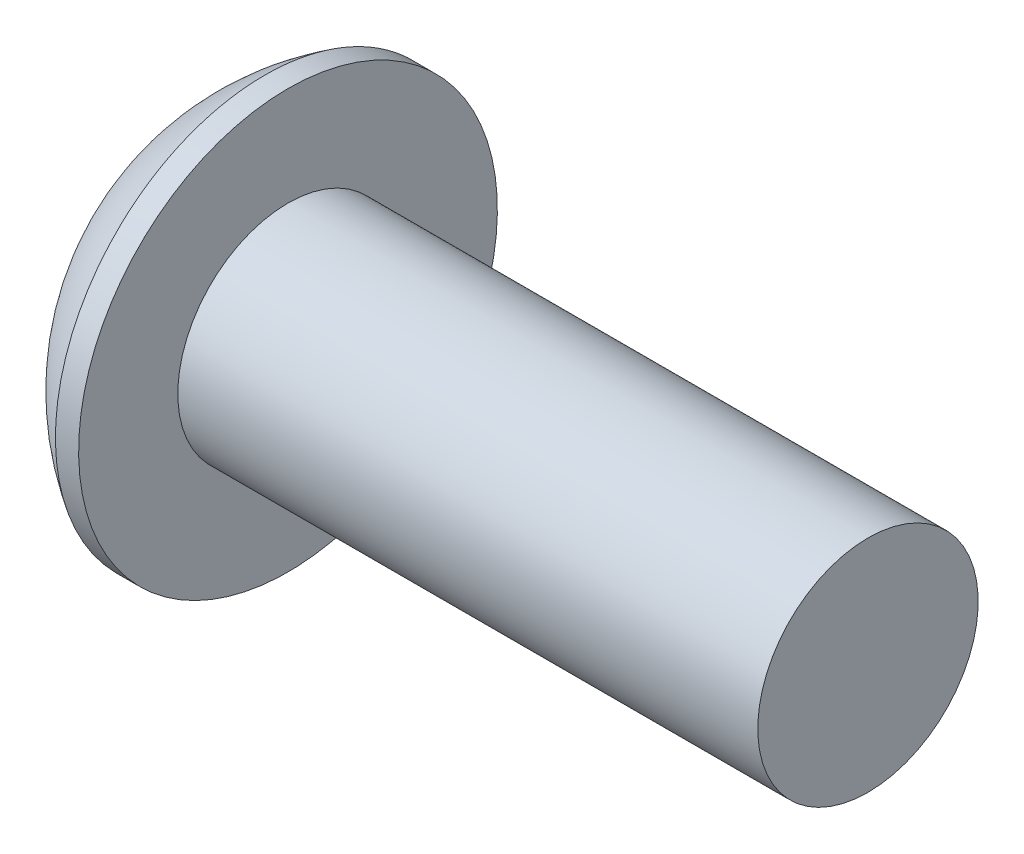
ISO-10303-21;
HEADER;
FILE_DESCRIPTION(('STEP AP214'),'2;1');
FILE_NAME('part.step','',(''),(''),'','','');
FILE_SCHEMA(('AUTOMOTIVE_DESIGN { 1 0 10303 214 1 1 1 1 }'));
ENDSEC;
DATA;
#1=APPLICATION_CONTEXT('core data for automotive mechanical design processes');
#2=APPLICATION_PROTOCOL_DEFINITION('international standard','automotive_design',2000,#1);
#3=PRODUCT_CONTEXT('',#1,'mechanical');
#4=PRODUCT('Part','Part','',(#3));
#5=PRODUCT_RELATED_PRODUCT_CATEGORY('part','',(#4));
#6=PRODUCT_DEFINITION_FORMATION('','',#4);
#7=PRODUCT_DEFINITION_CONTEXT('part definition',#1,'design');
#8=PRODUCT_DEFINITION('design','',#6,#7);
#9=PRODUCT_DEFINITION_SHAPE('','',#8);
#10=(LENGTH_UNIT() NAMED_UNIT(*) SI_UNIT(.MILLI.,.METRE.));
#11=(NAMED_UNIT(*) PLANE_ANGLE_UNIT() SI_UNIT($,.RADIAN.));
#12=(NAMED_UNIT(*) SI_UNIT($,.STERADIAN.) SOLID_ANGLE_UNIT());
#13=UNCERTAINTY_MEASURE_WITH_UNIT(LENGTH_MEASURE(1.E-05),#10,'distance_accuracy_value','');
#14=(GEOMETRIC_REPRESENTATION_CONTEXT(3) GLOBAL_UNCERTAINTY_ASSIGNED_CONTEXT((#13)) GLOBAL_UNIT_ASSIGNED_CONTEXT((#10,
#11,#12)) REPRESENTATION_CONTEXT('',''));
#15=CARTESIAN_POINT('',(0.,0.,0.));
#16=DIRECTION('',(0.,0.,1.));
#17=DIRECTION('',(1.,0.,0.));
#18=AXIS2_PLACEMENT_3D('',#15,#16,#17);
#19=CARTESIAN_POINT('',(-0.533400000000002,0.,0.));
#20=DIRECTION('',(-1.,0.,0.));
#21=DIRECTION('',(0.,0.,1.));
#22=AXIS2_PLACEMENT_3D('',#19,#20,#21);
#23=PLANE('',#22);
#24=DIRECTION('',(0.,0.5,0.866025403784439));
#25=VECTOR('',#24,1.);
#26=CARTESIAN_POINT('',(-0.533400000000002,1.83308710467706,0.));
#27=LINE('',#26,#25);
#28=CARTESIAN_POINT('',(-0.533400000000002,1.83308710467706,0.));
#29=VERTEX_POINT('',#28);
#30=CARTESIAN_POINT('',(-0.533400000000002,0.916543552338531,-1.5875));
#31=VERTEX_POINT('',#30);
#32=EDGE_CURVE('E115',#29,#31,#27,.F.);
#33=ORIENTED_EDGE('',*,*,#32,.T.);
#34=DIRECTION('',(0.,1.,0.));
#35=VECTOR('',#34,1.);
#36=CARTESIAN_POINT('',(-0.533400000000002,0.916543552338531,-1.5875));
#37=LINE('',#36,#35);
#38=CARTESIAN_POINT('',(-0.533400000000002,-0.916543552338531,-1.5875));
#39=VERTEX_POINT('',#38);
#40=EDGE_CURVE('E82',#31,#39,#37,.F.);
#41=ORIENTED_EDGE('',*,*,#40,.T.);
#42=DIRECTION('',(0.,0.5,-0.866025403784439));
#43=VECTOR('',#42,1.);
#44=CARTESIAN_POINT('',(-0.533400000000002,-0.916543552338531,-1.5875));
#45=LINE('',#44,#43);
#46=CARTESIAN_POINT('',(-0.533400000000002,-1.83308710467706,0.));
#47=VERTEX_POINT('',#46);
#48=EDGE_CURVE('E84',#39,#47,#45,.F.);
#49=ORIENTED_EDGE('',*,*,#48,.T.);
#50=DIRECTION('',(0.,-0.5,-0.866025403784439));
#51=VECTOR('',#50,1.);
#52=CARTESIAN_POINT('',(-0.533400000000002,-1.83308710467706,0.));
#53=LINE('',#52,#51);
#54=CARTESIAN_POINT('',(-0.533400000000002,-0.916543552338533,1.5875));
#55=VERTEX_POINT('',#54);
#56=EDGE_CURVE('E85',#47,#55,#53,.F.);
#57=ORIENTED_EDGE('',*,*,#56,.T.);
#58=DIRECTION('',(0.,-1.,0.));
#59=VECTOR('',#58,1.);
#60=CARTESIAN_POINT('',(-0.533400000000002,-0.916543552338532,1.5875));
#61=LINE('',#60,#59);
#62=CARTESIAN_POINT('',(-0.533400000000002,0.916543552338531,1.5875));
#63=VERTEX_POINT('',#62);
#64=EDGE_CURVE('E71',#55,#63,#61,.F.);
#65=ORIENTED_EDGE('',*,*,#64,.T.);
#66=DIRECTION('',(0.,-0.5,0.866025403784439));
#67=VECTOR('',#66,1.);
#68=CARTESIAN_POINT('',(-0.533400000000002,0.916543552338531,1.5875));
#69=LINE('',#68,#67);
#70=EDGE_CURVE('E110',#63,#29,#69,.F.);
#71=ORIENTED_EDGE('',*,*,#70,.T.);
#72=EDGE_LOOP('',(#33,#41,#49,#57,#65,#71));
#73=FACE_BOUND('',#72,.T.);
#74=ADVANCED_FACE('F17',(#73),#23,.T.);
#75=CARTESIAN_POINT('',(-0.533400000000002,-1.83308710467706,0.));
#76=DIRECTION('',(0.,-0.866025403784439,0.5));
#77=DIRECTION('',(0.,-0.5,-0.866025403784439));
#78=AXIS2_PLACEMENT_3D('',#75,#76,#77);
#79=PLANE('',#78);
#80=CARTESIAN_POINT('',(-2.56539999994394,-1.8330871046745,-2.00804498786736E-11));
#81=CARTESIAN_POINT('',(-2.53392818229741,-1.80158505518366,0.0545631502562923));
#82=CARTESIAN_POINT('',(-2.5043050627177,-1.76955629074211,0.110038597579172));
#83=CARTESIAN_POINT('',(-2.45006639539122,-1.70424635317817,0.223158727683824));
#84=CARTESIAN_POINT('',(-2.42548101615987,-1.6709589724711,0.280814162317604));
#85=CARTESIAN_POINT('',(-2.38336609605347,-1.60383660211837,0.397073518091736));
#86=CARTESIAN_POINT('',(-2.36573072948629,-1.57001869730198,0.455647847439699));
#87=CARTESIAN_POINT('',(-2.33856008862263,-1.50163859306838,0.574085662199493));
#88=CARTESIAN_POINT('',(-2.32900454007239,-1.46707848106388,0.633945532106421));
#89=CARTESIAN_POINT('',(-2.32038274183869,-1.40751253669323,0.737116774157155));
#90=CARTESIAN_POINT('',(-2.31910682172836,-1.38258360390154,0.780294952330845));
#91=CARTESIAN_POINT('',(-2.32125913780735,-1.33276652395073,0.866580665890379));
#92=CARTESIAN_POINT('',(-2.32468902284537,-1.30787839414808,0.90968817121394));
#93=CARTESIAN_POINT('',(-2.33605631415915,-1.25834345643267,0.995485200086784));
#94=CARTESIAN_POINT('',(-2.34399762019329,-1.23369687609494,1.03817432946455));
#95=CARTESIAN_POINT('',(-2.36395627681902,-1.18481740842653,1.12283605091316));
#96=CARTESIAN_POINT('',(-2.37597537628367,-1.16058470328902,1.16480832741616));
#97=CARTESIAN_POINT('',(-2.41164383187845,-1.09853862948576,1.27227527965358));
#98=CARTESIAN_POINT('',(-2.43797770752625,-1.06110942924036,1.33710455616529));
#99=CARTESIAN_POINT('',(-2.48243061452926,-1.00607390269188,1.43242888436855));
#100=CARTESIAN_POINT('',(-2.49804835924321,-0.987937988038022,1.46384120999077));
#101=CARTESIAN_POINT('',(-2.53070945051393,-0.951999508520197,1.52608848246242));
#102=CARTESIAN_POINT('',(-2.54775211871235,-0.934196789917587,1.55692369559499));
#103=CARTESIAN_POINT('',(-2.56539999993807,-0.916543552329633,1.58750000001541));
#104=B_SPLINE_CURVE_WITH_KNOTS('',3,(#80,#81,#82,#83,#84,#85,#86,#87,#88,#89,#90,#91,#92,#93,
#94,#95,#96,#97,#98,#99,#100,#101,#102,#103),.UNSPECIFIED.,.F.,.F.,(4,2,2,2,2,2,2,2,2,2,2,4),
(0.,0.211427927732169,0.424087197148228,0.633370156422424,0.842126401515785,0.991537201098734,
1.14100036552056,1.29059292577265,1.44024972414947,1.67781721417335,1.79627069411587,
1.91466809995991),.UNSPECIFIED.);
#105=CARTESIAN_POINT('',(-2.56539999993857,-1.83308710468646,0.));
#106=VERTEX_POINT('',#105);
#107=CARTESIAN_POINT('',(-2.56539999993106,-0.916543552342318,1.5875));
#108=VERTEX_POINT('',#107);
#109=EDGE_CURVE('E20',#106,#108,#104,.T.);
#110=ORIENTED_EDGE('',*,*,#109,.T.);
#111=DIRECTION('',(1.,0.,0.));
#112=VECTOR('',#111,1.);
#113=CARTESIAN_POINT('',(-0.533400000000002,-0.916543552338533,1.5875));
#114=LINE('',#113,#112);
#115=EDGE_CURVE('E90',#108,#55,#114,.T.);
#116=ORIENTED_EDGE('',*,*,#115,.T.);
#117=ORIENTED_EDGE('',*,*,#56,.F.);
#118=DIRECTION('',(1.,0.,0.));
#119=VECTOR('',#118,1.);
#120=CARTESIAN_POINT('',(-0.533400000000002,-1.83308710467706,0.));
#121=LINE('',#120,#119);
#122=EDGE_CURVE('E58',#47,#106,#121,.F.);
#123=ORIENTED_EDGE('',*,*,#122,.T.);
#124=EDGE_LOOP('',(#110,#116,#117,#123));
#125=FACE_BOUND('',#124,.T.);
#126=ADVANCED_FACE('F89',(#125),#79,.F.);
#127=CARTESIAN_POINT('',(-0.533400000000002,-0.916543552338531,-1.5875));
#128=DIRECTION('',(0.,-0.866025403784439,-0.5));
#129=DIRECTION('',(0.,0.5,-0.866025403784439));
#130=AXIS2_PLACEMENT_3D('',#127,#128,#129);
#131=PLANE('',#130);
#132=CARTESIAN_POINT('',(-2.56539999994527,-0.916543552319403,-1.58750000001409));
#133=CARTESIAN_POINT('',(-2.53392818229919,-0.948045601822691,-1.53293684974403));
#134=CARTESIAN_POINT('',(-2.50430506271949,-0.980074366269487,-1.47746140242354));
#135=CARTESIAN_POINT('',(-2.45006639539264,-1.04538430383757,-1.36434127232016));
#136=CARTESIAN_POINT('',(-2.42548101616093,-1.07867168454351,-1.30668583768523));
#137=CARTESIAN_POINT('',(-2.38336609605398,-1.14579405489574,-1.19042648190974));
#138=CARTESIAN_POINT('',(-2.36573072948662,-1.17961195971273,-1.13185215256154));
#139=CARTESIAN_POINT('',(-2.3385600886227,-1.2479920639471,-1.013414337801));
#140=CARTESIAN_POINT('',(-2.32900454007237,-1.28255217595175,-0.953554467893575));
#141=CARTESIAN_POINT('',(-2.32038274183866,-1.34211812032265,-0.850383225842316));
#142=CARTESIAN_POINT('',(-2.31910682172835,-1.36704705311438,-0.807205047668587));
#143=CARTESIAN_POINT('',(-2.32125913780739,-1.41686413306525,-0.720919334108961));
#144=CARTESIAN_POINT('',(-2.32468902284544,-1.44175226286793,-0.67781182878535));
#145=CARTESIAN_POINT('',(-2.33605631415929,-1.49128720058339,-0.592014799912417));
#146=CARTESIAN_POINT('',(-2.34399762019345,-1.51593378092113,-0.54932567053461));
#147=CARTESIAN_POINT('',(-2.36395627681926,-1.56481324858959,-0.464663949085931));
#148=CARTESIAN_POINT('',(-2.37597537628395,-1.58904595372712,-0.422691672582891));
#149=CARTESIAN_POINT('',(-2.41164383187876,-1.65109202753029,-0.315224720345625));
#150=CARTESIAN_POINT('',(-2.43797770752652,-1.6885212277756,-0.250395443834082));
#151=CARTESIAN_POINT('',(-2.48243061452944,-1.74355675432393,-0.15507111563107));
#152=CARTESIAN_POINT('',(-2.49804835924337,-1.76169266897775,-0.123658790008927));
#153=CARTESIAN_POINT('',(-2.53070945051401,-1.79763114849548,-0.0614115175374324));
#154=CARTESIAN_POINT('',(-2.5477521187124,-1.81543386709805,-0.0305763044049344));
#155=CARTESIAN_POINT('',(-2.56539999993807,-1.83308710468596,1.54136844652939E-11));
#156=B_SPLINE_CURVE_WITH_KNOTS('',3,(#132,#133,#134,#135,#136,#137,#138,#139,#140,#141,#142,
#143,#144,#145,#146,#147,#148,#149,#150,#151,#152,#153,#154,#155),.UNSPECIFIED.,.F.,.F.,(4,2,2,
2,2,2,2,2,2,2,2,4),(0.,0.211427927733669,0.424087197151313,0.633370156427101,0.842126401522016,
0.99153720110513,1.14100036552713,1.29059292577937,1.44024972415633,1.67781721417961,
1.79627069412184,1.9146680999656),.UNSPECIFIED.);
#157=CARTESIAN_POINT('',(-2.56539999995198,-0.916543552351339,-1.58750000002218));
#158=VERTEX_POINT('',#157);
#159=EDGE_CURVE('E94',#158,#106,#156,.T.);
#160=ORIENTED_EDGE('',*,*,#159,.T.);
#161=ORIENTED_EDGE('',*,*,#122,.F.);
#162=ORIENTED_EDGE('',*,*,#48,.F.);
#163=DIRECTION('',(-1.,0.,0.));
#164=VECTOR('',#163,1.);
#165=CARTESIAN_POINT('',(-0.533400000000002,-0.916543552338531,-1.5875));
#166=LINE('',#165,#164);
#167=EDGE_CURVE('E96',#39,#158,#166,.T.);
#168=ORIENTED_EDGE('',*,*,#167,.T.);
#169=EDGE_LOOP('',(#160,#161,#162,#168));
#170=FACE_BOUND('',#169,.T.);
#171=ADVANCED_FACE('F92',(#170),#131,.F.);
#172=CARTESIAN_POINT('',(-0.533400000000002,0.916543552338531,-1.5875));
#173=DIRECTION('',(0.,0.,-1.));
#174=DIRECTION('',(-1.,0.,0.));
#175=AXIS2_PLACEMENT_3D('',#172,#173,#174);
#176=PLANE('',#175);
#177=CARTESIAN_POINT('',(-2.56539999994527,0.916543552360294,-1.58749999999048));
#178=CARTESIAN_POINT('',(-2.53392818229821,0.853539453376781,-1.58749999999657));
#179=CARTESIAN_POINT('',(-2.50430506271702,0.789481924500113,-1.58749999999908));
#180=CARTESIAN_POINT('',(-2.45006639538581,0.658862049392287,-1.58750000000093));
#181=CARTESIAN_POINT('',(-2.42548101615122,0.59228728799181,-1.58750000000025));
#182=CARTESIAN_POINT('',(-2.38336609603683,0.458042547310979,-1.58749999999976));
#183=CARTESIAN_POINT('',(-2.36573072946494,0.390406737689213,-1.58749999999994));
#184=CARTESIAN_POINT('',(-2.3385600885904,0.253646529243895,-1.58750000000006));
#185=CARTESIAN_POINT('',(-2.32900454003397,0.184526305245804,-1.58750000000001));
#186=CARTESIAN_POINT('',(-2.32038274178942,0.0653944165301613,-1.58749999999999));
#187=CARTESIAN_POINT('',(-2.31910682167392,0.0155365509618711,-1.5875));
#188=CARTESIAN_POINT('',(-2.3212591377409,-0.0840976089101244,-1.5875));
#189=CARTESIAN_POINT('',(-2.32468902277208,-0.133873868500894,-1.5875));
#190=CARTESIAN_POINT('',(-2.33605631407098,-0.2329437439033,-1.5875));
#191=CARTESIAN_POINT('',(-2.34399762009707,-0.282236904564879,-1.5875));
#192=CARTESIAN_POINT('',(-2.36395627670599,-0.379995839874564,-1.5875));
#193=CARTESIAN_POINT('',(-2.37597537616188,-0.428461250136325,-1.5875));
#194=CARTESIAN_POINT('',(-2.41164383175616,-0.552553397787632,-1.5875));
#195=CARTESIAN_POINT('',(-2.43797770742117,-0.627411798334259,-1.5875));
#196=CARTESIAN_POINT('',(-2.48243061445881,-0.737482851511091,-1.5875));
#197=CARTESIAN_POINT('',(-2.49804835918582,-0.773754680844889,-1.5875));
#198=CARTESIAN_POINT('',(-2.53070945048496,-0.845631639931401,-1.5875));
#199=CARTESIAN_POINT('',(-2.54775211869874,-0.881237077161412,-1.5875));
#200=CARTESIAN_POINT('',(-2.56539999994071,-0.916543552361606,-1.5875));
#201=B_SPLINE_CURVE_WITH_KNOTS('',3,(#177,#178,#179,#180,#181,#182,#183,#184,#185,#186,#187,
#188,#189,#190,#191,#192,#193,#194,#195,#196,#197,#198,#199,#200),.UNSPECIFIED.,.F.,.F.,(4,2,2,
2,2,2,2,2,2,2,2,4),(0.,0.211427927701375,0.424087197086717,0.633370156331471,0.842126401395377,
0.991537200933545,1.14100036531054,1.29059292551773,1.44024972384963,1.677817214047,
1.79627069407681,1.91466810000777),.UNSPECIFIED.);
#202=CARTESIAN_POINT('',(-2.56539999995198,0.916543552337129,-1.58749999999757));
#203=VERTEX_POINT('',#202);
#204=EDGE_CURVE('E198',#203,#158,#201,.T.);
#205=ORIENTED_EDGE('',*,*,#204,.T.);
#206=ORIENTED_EDGE('',*,*,#167,.F.);
#207=ORIENTED_EDGE('',*,*,#40,.F.);
#208=DIRECTION('',(1.,0.,0.));
#209=VECTOR('',#208,1.);
#210=CARTESIAN_POINT('',(-0.533400000000002,0.916543552338531,-1.5875));
#211=LINE('',#210,#209);
#212=EDGE_CURVE('E112',#31,#203,#211,.F.);
#213=ORIENTED_EDGE('',*,*,#212,.T.);
#214=EDGE_LOOP('',(#205,#206,#207,#213));
#215=FACE_BOUND('',#214,.T.);
#216=ADVANCED_FACE('F188',(#215),#176,.F.);
#217=CARTESIAN_POINT('',(-0.533400000000002,1.83308710467706,0.));
#218=DIRECTION('',(0.,0.866025403784439,-0.5));
#219=DIRECTION('',(0.,0.5,0.866025403784439));
#220=AXIS2_PLACEMENT_3D('',#217,#218,#219);
#221=PLANE('',#220);
#222=CARTESIAN_POINT('',(-2.56539999994394,1.8330871046745,2.00800374309997E-11));
#223=CARTESIAN_POINT('',(-2.5339281822974,1.80158505518366,-0.0545631502562965));
#224=CARTESIAN_POINT('',(-2.5043050627177,1.76955629074211,-0.11003859757918));
#225=CARTESIAN_POINT('',(-2.45006639539121,1.70424635317816,-0.22315872768384));
#226=CARTESIAN_POINT('',(-2.42548101615987,1.67095897247109,-0.280814162317626));
#227=CARTESIAN_POINT('',(-2.38336609605347,1.60383660211835,-0.397073518091758));
#228=CARTESIAN_POINT('',(-2.36573072948628,1.57001869730197,-0.455647847439717));
#229=CARTESIAN_POINT('',(-2.33856008862263,1.50163859306837,-0.574085662199503));
#230=CARTESIAN_POINT('',(-2.32900454007239,1.46707848106388,-0.633945532106426));
#231=CARTESIAN_POINT('',(-2.32038274183869,1.40751253669322,-0.737116774157154));
#232=CARTESIAN_POINT('',(-2.31910682172836,1.38258360390154,-0.780294952330843));
#233=CARTESIAN_POINT('',(-2.32125913780735,1.33276652395073,-0.866580665890374));
#234=CARTESIAN_POINT('',(-2.32468902284537,1.30787839414808,-0.909688171213933));
#235=CARTESIAN_POINT('',(-2.33605631415915,1.25834345643267,-0.995485200086777));
#236=CARTESIAN_POINT('',(-2.34399762019328,1.23369687609495,-1.03817432946455));
#237=CARTESIAN_POINT('',(-2.36395627681902,1.18481740842653,-1.12283605091316));
#238=CARTESIAN_POINT('',(-2.37597537628367,1.16058470328902,-1.16480832741616));
#239=CARTESIAN_POINT('',(-2.41164383187872,1.09853862948529,-1.2722752796544));
#240=CARTESIAN_POINT('',(-2.43797770752691,1.06110942923942,-1.33710455616691));
#241=CARTESIAN_POINT('',(-2.48243061453059,1.00607390269029,-1.43242888437131));
#242=CARTESIAN_POINT('',(-2.49804835924479,0.987937988036214,-1.4638412099939));
#243=CARTESIAN_POINT('',(-2.53070945051602,0.951999508517968,-1.52608848246628));
#244=CARTESIAN_POINT('',(-2.54775211871471,0.934196789915152,-1.55692369559921));
#245=CARTESIAN_POINT('',(-2.56539999994071,0.916543552326994,-1.58750000001998));
#246=B_SPLINE_CURVE_WITH_KNOTS('',3,(#222,#223,#224,#225,#226,#227,#228,#229,#230,#231,#232,
#233,#234,#235,#236,#237,#238,#239,#240,#241,#242,#243,#244,#245),.UNSPECIFIED.,.F.,.F.,(4,2,2,
2,2,2,2,2,2,2,2,4),(0.,0.211427927732185,0.424087197148259,0.63337015642244,0.842126401515786,
0.99153720109873,1.14100036552055,1.29059292577265,1.44024972414947,1.67781721417631,
1.7962706941203,1.9146680999658),.UNSPECIFIED.);
#247=CARTESIAN_POINT('',(-2.56539999993857,1.83308710468646,0.));
#248=VERTEX_POINT('',#247);
#249=EDGE_CURVE('E192',#248,#203,#246,.T.);
#250=ORIENTED_EDGE('',*,*,#249,.T.);
#251=ORIENTED_EDGE('',*,*,#212,.F.);
#252=ORIENTED_EDGE('',*,*,#32,.F.);
#253=DIRECTION('',(1.,0.,0.));
#254=VECTOR('',#253,1.);
#255=CARTESIAN_POINT('',(-0.533400000000002,1.83308710467706,0.));
#256=LINE('',#255,#254);
#257=EDGE_CURVE('E107',#29,#248,#256,.F.);
#258=ORIENTED_EDGE('',*,*,#257,.T.);
#259=EDGE_LOOP('',(#250,#251,#252,#258));
#260=FACE_BOUND('',#259,.T.);
#261=ADVANCED_FACE('F184',(#260),#221,.F.);
#262=CARTESIAN_POINT('',(-0.533400000000002,0.916543552338531,1.5875));
#263=DIRECTION('',(0.,0.866025403784439,0.5));
#264=DIRECTION('',(0.,-0.5,0.866025403784439));
#265=AXIS2_PLACEMENT_3D('',#262,#263,#264);
#266=PLANE('',#265);
#267=CARTESIAN_POINT('',(-2.56539999994394,0.91654355231986,1.58750000000782));
#268=CARTESIAN_POINT('',(-2.53392818229741,0.948045601824288,1.5329368497393));
#269=CARTESIAN_POINT('',(-2.5043050627177,0.980074366271431,1.47746140241964));
#270=CARTESIAN_POINT('',(-2.45006639539122,1.04538430383949,1.36434127231737));
#271=CARTESIAN_POINT('',(-2.42548101615987,1.07867168454504,1.30668583768271));
#272=CARTESIAN_POINT('',(-2.38336609605347,1.14579405489669,1.19042648190795));
#273=CARTESIAN_POINT('',(-2.36573072948629,1.17961195971347,1.13185215256022));
#274=CARTESIAN_POINT('',(-2.33856008862263,1.24799206394736,1.01341433780059));
#275=CARTESIAN_POINT('',(-2.32900454007239,1.28255217595174,0.953554467893597));
#276=CARTESIAN_POINT('',(-2.32038274183869,1.34211812032234,0.850383225842832));
#277=CARTESIAN_POINT('',(-2.31910682172836,1.36704705311405,0.807205047669152));
#278=CARTESIAN_POINT('',(-2.32125913780735,1.41686413306487,0.720919334109624));
#279=CARTESIAN_POINT('',(-2.32468902284537,1.44175226286752,0.677811828786061));
#280=CARTESIAN_POINT('',(-2.33605631415915,1.49128720058292,0.592014799913215));
#281=CARTESIAN_POINT('',(-2.34399762019328,1.51593378092065,0.549325670535446));
#282=CARTESIAN_POINT('',(-2.36395627681902,1.56481324858906,0.464663949086841));
#283=CARTESIAN_POINT('',(-2.37597537628367,1.58904595372657,0.422691672583837));
#284=CARTESIAN_POINT('',(-2.41164383187845,1.65109202752983,0.315224720346425));
#285=CARTESIAN_POINT('',(-2.43797770752625,1.68852122777524,0.250395443834706));
#286=CARTESIAN_POINT('',(-2.48243061452926,1.74355675432371,0.155071115631445));
#287=CARTESIAN_POINT('',(-2.49804835924321,1.76169266897757,0.123658790009225));
#288=CARTESIAN_POINT('',(-2.53070945051393,1.7976311484954,0.0614115175375789));
#289=CARTESIAN_POINT('',(-2.54775211871235,1.81543386709801,0.0305763044050067));
#290=CARTESIAN_POINT('',(-2.56539999993807,1.83308710468596,-1.54142580803093E-11));
#291=B_SPLINE_CURVE_WITH_KNOTS('',3,(#267,#268,#269,#270,#271,#272,#273,#274,#275,#276,#277,
#278,#279,#280,#281,#282,#283,#284,#285,#286,#287,#288,#289,#290),.UNSPECIFIED.,.F.,.F.,(4,2,2,
2,2,2,2,2,2,2,2,4),(0.,0.211427927732169,0.424087197148227,0.633370156422423,0.842126401515785,
0.991537201098733,1.14100036552056,1.29059292577265,1.44024972414946,1.67781721417335,
1.79627069411587,1.91466809995991),.UNSPECIFIED.);
#292=CARTESIAN_POINT('',(-2.56539999993857,0.91654355234323,1.58750000000814));
#293=VERTEX_POINT('',#292);
#294=EDGE_CURVE('E166',#293,#248,#291,.T.);
#295=ORIENTED_EDGE('',*,*,#294,.T.);
#296=ORIENTED_EDGE('',*,*,#257,.F.);
#297=ORIENTED_EDGE('',*,*,#70,.F.);
#298=DIRECTION('',(1.,0.,0.));
#299=VECTOR('',#298,1.);
#300=CARTESIAN_POINT('',(-0.533400000000002,0.916543552338531,1.5875));
#301=LINE('',#300,#299);
#302=EDGE_CURVE('E39',#63,#293,#301,.F.);
#303=ORIENTED_EDGE('',*,*,#302,.T.);
#304=EDGE_LOOP('',(#295,#296,#297,#303));
#305=FACE_BOUND('',#304,.T.);
#306=ADVANCED_FACE('F177',(#305),#266,.F.);
#307=CARTESIAN_POINT('',(-0.533400000000002,-0.916543552338532,1.5875));
#308=DIRECTION('',(0.,0.,1.));
#309=DIRECTION('',(0.,-1.,0.));
#310=AXIS2_PLACEMENT_3D('',#307,#308,#309);
#311=PLANE('',#310);
#312=CARTESIAN_POINT('',(-2.56539999994394,-0.916543552354642,1.58749999998774));
#313=CARTESIAN_POINT('',(-2.53392818229741,-0.853539453359365,1.58749999999559));
#314=CARTESIAN_POINT('',(-2.50430506271771,-0.789481924470656,1.58749999999882));
#315=CARTESIAN_POINT('',(-2.45006639539122,-0.658862049338629,1.58750000000119));
#316=CARTESIAN_POINT('',(-2.42548101615988,-0.592287287925995,1.58750000000032));
#317=CARTESIAN_POINT('',(-2.38336609605349,-0.458042547221593,1.58749999999969));
#318=CARTESIAN_POINT('',(-2.36573072948631,-0.390406737588416,1.58749999999992));
#319=CARTESIAN_POINT('',(-2.33856008862266,-0.253646529120892,1.58750000000008));
#320=CARTESIAN_POINT('',(-2.32900454007243,-0.184526305112002,1.58750000000002));
#321=CARTESIAN_POINT('',(-2.32038274183874,-0.065394416370719,1.58749999999999));
#322=CARTESIAN_POINT('',(-2.31910682172841,-0.0155365507873145,1.5875));
#323=CARTESIAN_POINT('',(-2.32125913780742,0.0840976091143436,1.5875));
#324=CARTESIAN_POINT('',(-2.32468902284545,0.133873868719661,1.5875));
#325=CARTESIAN_POINT('',(-2.33605631415924,0.232943744150505,1.5875));
#326=CARTESIAN_POINT('',(-2.34399762019338,0.282236904825971,1.5875));
#327=CARTESIAN_POINT('',(-2.36395627681913,0.379995840162817,1.5875));
#328=CARTESIAN_POINT('',(-2.37597537628379,0.428461250437852,1.5875));
#329=CARTESIAN_POINT('',(-2.41164383187857,0.552553398044325,1.5875));
#330=CARTESIAN_POINT('',(-2.43797770752636,0.627411798535089,1.5875));
#331=CARTESIAN_POINT('',(-2.48243061452933,0.737482851631955,1.5875));
#332=CARTESIAN_POINT('',(-2.49804835924327,0.773754680939651,1.5875));
#333=CARTESIAN_POINT('',(-2.53070945051396,0.84563163997525,1.5875));
#334=CARTESIAN_POINT('',(-2.54775211871237,0.881237077180446,1.5875));
#335=CARTESIAN_POINT('',(-2.56539999993807,0.91654355235633,1.5875));
#336=B_SPLINE_CURVE_WITH_KNOTS('',3,(#312,#313,#314,#315,#316,#317,#318,#319,#320,#321,#322,
#323,#324,#325,#326,#327,#328,#329,#330,#331,#332,#333,#334,#335),.UNSPECIFIED.,.F.,.F.,(4,2,2,
2,2,2,2,2,2,2,2,4),(0.,0.211427927732202,0.424087197148294,0.633370156422521,0.842126401515914,
0.991537201098908,1.14100036552078,1.29059292577292,1.44024972414978,1.67781721417349,
1.79627069411592,1.91466809995988),.UNSPECIFIED.);
#337=EDGE_CURVE('E158',#108,#293,#336,.T.);
#338=ORIENTED_EDGE('',*,*,#337,.T.);
#339=ORIENTED_EDGE('',*,*,#302,.F.);
#340=ORIENTED_EDGE('',*,*,#64,.F.);
#341=ORIENTED_EDGE('',*,*,#115,.F.);
#342=EDGE_LOOP('',(#338,#339,#340,#341));
#343=FACE_BOUND('',#342,.T.);
#344=ADVANCED_FACE('F173',(#343),#311,.F.);
#345=CARTESIAN_POINT('',(-2.56540000003724,0.,0.));
#346=DIRECTION('',(-1.,0.,0.));
#347=DIRECTION('',(0.,-1.,0.));
#348=AXIS2_PLACEMENT_3D('',#345,#346,#347);
#349=CONICAL_SURFACE('',#348,1.83308710478514,0.78539816351237);
#350=ORIENTED_EDGE('',*,*,#109,.F.);
#351=CARTESIAN_POINT('',(-2.56539999992356,0.,0.));
#352=DIRECTION('',(-1.,0.,0.));
#353=DIRECTION('',(0.,-1.,0.));
#354=AXIS2_PLACEMENT_3D('',#351,#352,#353);
#355=CIRCLE('',#354,1.83308710467145);
#356=EDGE_CURVE('E165',#108,#106,#355,.F.);
#357=ORIENTED_EDGE('',*,*,#356,.F.);
#358=EDGE_LOOP('',(#350,#357));
#359=FACE_BOUND('',#358,.T.);
#360=ADVANCED_FACE('F176',(#359),#349,.F.);
#361=CARTESIAN_POINT('',(-2.56540000003724,0.,0.));
#362=DIRECTION('',(-1.,0.,0.));
#363=DIRECTION('',(0.,-1.,0.));
#364=AXIS2_PLACEMENT_3D('',#361,#362,#363);
#365=CONICAL_SURFACE('',#364,1.83308710478514,0.78539816351237);
#366=ORIENTED_EDGE('',*,*,#159,.F.);
#367=CARTESIAN_POINT('',(-2.56539999992356,0.,0.));
#368=DIRECTION('',(-1.,0.,0.));
#369=DIRECTION('',(0.,-1.,0.));
#370=AXIS2_PLACEMENT_3D('',#367,#368,#369);
#371=CIRCLE('',#370,1.83308710467145);
#372=EDGE_CURVE('E272',#106,#158,#371,.F.);
#373=ORIENTED_EDGE('',*,*,#372,.F.);
#374=EDGE_LOOP('',(#366,#373));
#375=FACE_BOUND('',#374,.T.);
#376=ADVANCED_FACE('F210',(#375),#365,.F.);
#377=CARTESIAN_POINT('',(-2.56540000003724,0.,0.));
#378=DIRECTION('',(-1.,0.,0.));
#379=DIRECTION('',(0.,-1.,0.));
#380=AXIS2_PLACEMENT_3D('',#377,#378,#379);
#381=CONICAL_SURFACE('',#380,1.83308710478514,0.785398163397448);
#382=ORIENTED_EDGE('',*,*,#204,.F.);
#383=CARTESIAN_POINT('',(-2.5653999999804,0.,0.));
#384=DIRECTION('',(-1.,0.,0.));
#385=DIRECTION('',(0.,-1.,0.));
#386=AXIS2_PLACEMENT_3D('',#383,#384,#385);
#387=CIRCLE('',#386,1.83308710472829);
#388=EDGE_CURVE('E269',#158,#203,#387,.F.);
#389=ORIENTED_EDGE('',*,*,#388,.F.);
#390=EDGE_LOOP('',(#382,#389));
#391=FACE_BOUND('',#390,.T.);
#392=ADVANCED_FACE('F206',(#391),#381,.F.);
#393=CARTESIAN_POINT('',(-2.56540000003724,0.,0.));
#394=DIRECTION('',(-1.,0.,0.));
#395=DIRECTION('',(0.,-1.,0.));
#396=AXIS2_PLACEMENT_3D('',#393,#394,#395);
#397=CONICAL_SURFACE('',#396,1.83308710478514,0.78539816351237);
#398=ORIENTED_EDGE('',*,*,#249,.F.);
#399=CARTESIAN_POINT('',(-2.56539999992356,0.,0.));
#400=DIRECTION('',(-1.,0.,0.));
#401=DIRECTION('',(0.,-1.,0.));
#402=AXIS2_PLACEMENT_3D('',#399,#400,#401);
#403=CIRCLE('',#402,1.83308710467145);
#404=EDGE_CURVE('E266',#203,#248,#403,.F.);
#405=ORIENTED_EDGE('',*,*,#404,.F.);
#406=EDGE_LOOP('',(#398,#405));
#407=FACE_BOUND('',#406,.T.);
#408=ADVANCED_FACE('F203',(#407),#397,.F.);
#409=CARTESIAN_POINT('',(-2.56540000003724,0.,0.));
#410=DIRECTION('',(-1.,0.,0.));
#411=DIRECTION('',(0.,-1.,0.));
#412=AXIS2_PLACEMENT_3D('',#409,#410,#411);
#413=CONICAL_SURFACE('',#412,1.83308710478514,0.78539816351237);
#414=ORIENTED_EDGE('',*,*,#294,.F.);
#415=CARTESIAN_POINT('',(-2.56539999992356,0.,0.));
#416=DIRECTION('',(-1.,0.,0.));
#417=DIRECTION('',(0.,-1.,0.));
#418=AXIS2_PLACEMENT_3D('',#415,#416,#417);
#419=CIRCLE('',#418,1.83308710467145);
#420=EDGE_CURVE('E261',#248,#293,#419,.F.);
#421=ORIENTED_EDGE('',*,*,#420,.F.);
#422=EDGE_LOOP('',(#414,#421));
#423=FACE_BOUND('',#422,.T.);
#424=ADVANCED_FACE('F153',(#423),#413,.F.);
#425=CARTESIAN_POINT('',(-2.56540000003724,0.,0.));
#426=DIRECTION('',(-1.,0.,0.));
#427=DIRECTION('',(0.,-1.,0.));
#428=AXIS2_PLACEMENT_3D('',#425,#426,#427);
#429=CONICAL_SURFACE('',#428,1.83308710478514,0.785398163512485);
#430=ORIENTED_EDGE('',*,*,#337,.F.);
#431=CARTESIAN_POINT('',(-2.56539999992356,0.,0.));
#432=DIRECTION('',(-1.,0.,0.));
#433=DIRECTION('',(0.,-1.,0.));
#434=AXIS2_PLACEMENT_3D('',#431,#432,#433);
#435=CIRCLE('',#434,1.83308710467145);
#436=EDGE_CURVE('E138',#293,#108,#435,.F.);
#437=ORIENTED_EDGE('',*,*,#436,.F.);
#438=EDGE_LOOP('',(#430,#437));
#439=FACE_BOUND('',#438,.T.);
#440=ADVANCED_FACE('F148',(#439),#429,.F.);
#441=CARTESIAN_POINT('',(-2.5654,0.,0.));
#442=DIRECTION('',(-1.,0.,0.));
#443=DIRECTION('',(0.,-1.,0.));
#444=AXIS2_PLACEMENT_3D('',#441,#442,#443);
#445=PLANE('',#444);
#446=CARTESIAN_POINT('',(-2.5654,-2.29235000000002,0.));
#447=CARTESIAN_POINT('',(-2.56540000000001,-2.29234961429958,-0.0643619991867162));
#448=CARTESIAN_POINT('',(-2.56540000000002,-2.28963695190109,-0.128735826629366));
#449=CARTESIAN_POINT('',(-2.56539999999999,-2.27880393843649,-0.257038618985287));
#450=CARTESIAN_POINT('',(-2.56539999999995,-2.27068199085128,-0.320967446929163));
#451=CARTESIAN_POINT('',(-2.56540000000006,-2.24906694794257,-0.448021254607718));
#452=CARTESIAN_POINT('',(-2.56540000000021,-2.23556532653462,-0.511144793381861));
#453=CARTESIAN_POINT('',(-2.56539999999979,-2.20328400495645,-0.636065176149322));
#454=CARTESIAN_POINT('',(-2.56539999999921,-2.18450002159115,-0.697860899533935));
#455=CARTESIAN_POINT('',(-2.56539999999869,-2.12048422735804,-0.88032980292775));
#456=CARTESIAN_POINT('',(-2.56539999999995,-2.0675359907946,-0.99839179592812));
#457=CARTESIAN_POINT('',(-2.56540000000006,-1.94254204858674,-1.22393765942148));
#458=CARTESIAN_POINT('',(-2.56539999999891,-1.87049561696644,-1.33142112758208));
#459=CARTESIAN_POINT('',(-2.56539999999932,-1.74974254194881,-1.48237719670935));
#460=CARTESIAN_POINT('',(-2.56539999999982,-1.70734573132302,-1.53101280076738));
#461=CARTESIAN_POINT('',(-2.56540000000018,-1.6186391029153,-1.62450601319185));
#462=CARTESIAN_POINT('',(-2.56540000000005,-1.57233309727313,-1.66936721890417));
#463=CARTESIAN_POINT('',(-2.56539999999995,-1.47608431707234,-1.7550488420402));
#464=CARTESIAN_POINT('',(-2.56539999999999,-1.42613990458995,-1.79586741981512));
#465=CARTESIAN_POINT('',(-2.56540000000002,-1.32299452541252,-1.87315615311523));
#466=CARTESIAN_POINT('',(-2.56540000000001,-1.26979280714188,-1.90962529930697));
#467=CARTESIAN_POINT('',(-2.56539999999999,-1.10588180153953,-2.0120772215109));
#468=CARTESIAN_POINT('',(-2.5654,-0.990764947001321,-2.07119486286667));
#469=CARTESIAN_POINT('',(-2.5654,-0.752302198839727,-2.16922858468856));
#470=CARTESIAN_POINT('',(-2.5654,-0.628956393121269,-2.2081448809145));
#471=CARTESIAN_POINT('',(-2.5654,-0.377466101733277,-2.2647275576592));
#472=CARTESIAN_POINT('',(-2.5654,-0.249321590440388,-2.28239382469379));
#473=CARTESIAN_POINT('',(-2.5654,0.0081143537161001,-2.29595665980956));
#474=CARTESIAN_POINT('',(-2.5654,0.137405786579698,-2.29185322789073));
#475=CARTESIAN_POINT('',(-2.5654,0.393449386933719,-2.2620096240906));
#476=CARTESIAN_POINT('',(-2.5654,0.520201567981077,-2.23626956775766));
#477=CARTESIAN_POINT('',(-2.5654,0.767645294384444,-2.16383549332687));
#478=CARTESIAN_POINT('',(-2.5654,0.888336774993549,-2.11714125142686));
#479=CARTESIAN_POINT('',(-2.5654,1.06210572146655,-2.03247976453654));
#480=CARTESIAN_POINT('',(-2.5654,1.11884498714066,-2.00180278323696));
#481=CARTESIAN_POINT('',(-2.5654,1.22954062855572,-1.93578011658036));
#482=CARTESIAN_POINT('',(-2.5654,1.28349764565392,-1.9004355139425));
#483=CARTESIAN_POINT('',(-2.5654,1.38821676641537,-1.82534174602348));
#484=CARTESIAN_POINT('',(-2.5654,1.43898030563028,-1.78559458231503));
#485=CARTESIAN_POINT('',(-2.5654,1.53701984534431,-1.70193996292362));
#486=CARTESIAN_POINT('',(-2.5654,1.5842924328055,-1.65802852924127));
#487=CARTESIAN_POINT('',(-2.5654,1.72023903553758,-1.52059650554139));
#488=CARTESIAN_POINT('',(-2.5654,1.80318066138239,-1.42127847626519));
#489=CARTESIAN_POINT('',(-2.5654,1.95118232345098,-1.21011519784664));
#490=CARTESIAN_POINT('',(-2.5654,2.01624303935584,-1.09827042509272));
#491=CARTESIAN_POINT('',(-2.5654,2.09907772661314,-0.923538238005839));
#492=CARTESIAN_POINT('',(-2.5654,2.12425103063558,-0.864058373981966));
#493=CARTESIAN_POINT('',(-2.5654,2.16947990046565,-0.743221562175601));
#494=CARTESIAN_POINT('',(-2.5654,2.18953960800684,-0.681866178863365));
#495=CARTESIAN_POINT('',(-2.5654,2.22438542051156,-0.557786972400356));
#496=CARTESIAN_POINT('',(-2.5654,2.23917985294818,-0.495065478128172));
#497=CARTESIAN_POINT('',(-2.5654,2.26343456384453,-0.368611258323514));
#498=CARTESIAN_POINT('',(-2.5654,2.27289641559285,-0.304878836759566));
#499=CARTESIAN_POINT('',(-2.5654,2.28388649696736,-0.200873029360621));
#500=CARTESIAN_POINT('',(-2.5654,2.28705930623293,-0.160766164180096));
#501=CARTESIAN_POINT('',(-2.5654,2.29129117827044,-0.0804410725432706));
#502=CARTESIAN_POINT('',(-2.5654,2.29235024104238,-0.0402228460869715));
#503=CARTESIAN_POINT('',(-2.56540000000001,2.29234961429956,0.0643619991867166));
#504=CARTESIAN_POINT('',(-2.56540000000002,2.28963695190107,0.128735826629366));
#505=CARTESIAN_POINT('',(-2.56539999999999,2.27880393843648,0.257038618985288));
#506=CARTESIAN_POINT('',(-2.56539999999995,2.27068199085126,0.320967446929163));
#507=CARTESIAN_POINT('',(-2.56540000000006,2.24906694794255,0.448021254607719));
#508=CARTESIAN_POINT('',(-2.56540000000021,2.2355653265346,0.511144793381862));
#509=CARTESIAN_POINT('',(-2.56539999999979,2.20328400495644,0.636065176149322));
#510=CARTESIAN_POINT('',(-2.56539999999921,2.18450002159113,0.697860899533936));
#511=CARTESIAN_POINT('',(-2.56539999999869,2.12048422735802,0.88032980292775));
#512=CARTESIAN_POINT('',(-2.56539999999995,2.06753599079459,0.998391795928119));
#513=CARTESIAN_POINT('',(-2.56540000000006,1.94254204858672,1.22393765942147));
#514=CARTESIAN_POINT('',(-2.56539999999891,1.87049561696642,1.33142112758208));
#515=CARTESIAN_POINT('',(-2.56539999999933,1.7497425419488,1.48237719670935));
#516=CARTESIAN_POINT('',(-2.56539999999982,1.707345731323,1.53101280076738));
#517=CARTESIAN_POINT('',(-2.56540000000018,1.61863910291529,1.62450601319185));
#518=CARTESIAN_POINT('',(-2.56540000000005,1.57233309727312,1.66936721890418));
#519=CARTESIAN_POINT('',(-2.56539999999995,1.47608431707233,1.75504884204021));
#520=CARTESIAN_POINT('',(-2.56539999999999,1.42613990458993,1.79586741981512));
#521=CARTESIAN_POINT('',(-2.56540000000002,1.3229945254125,1.87315615311523));
#522=CARTESIAN_POINT('',(-2.56540000000001,1.26979280714187,1.90962529930697));
#523=CARTESIAN_POINT('',(-2.56539999999999,1.10588180153952,2.0120772215109));
#524=CARTESIAN_POINT('',(-2.5654,0.990764947001304,2.07119486286667));
#525=CARTESIAN_POINT('',(-2.5654,0.75230219883971,2.16922858468856));
#526=CARTESIAN_POINT('',(-2.5654,0.628956393121252,2.2081448809145));
#527=CARTESIAN_POINT('',(-2.5654,0.377466101733262,2.2647275576592));
#528=CARTESIAN_POINT('',(-2.5654,0.249321590440372,2.28239382469379));
#529=CARTESIAN_POINT('',(-2.5654,-0.00811435371611611,2.29595665980955));
#530=CARTESIAN_POINT('',(-2.5654,-0.137405786579714,2.29185322789072));
#531=CARTESIAN_POINT('',(-2.5654,-0.393449386933735,2.2620096240906));
#532=CARTESIAN_POINT('',(-2.5654,-0.520201567981094,2.23626956775766));
#533=CARTESIAN_POINT('',(-2.5654,-0.767645294384462,2.16383549332688));
#534=CARTESIAN_POINT('',(-2.5654,-0.888336774993567,2.11714125142686));
#535=CARTESIAN_POINT('',(-2.5654,-1.06210572146657,2.03247976453654));
#536=CARTESIAN_POINT('',(-2.5654,-1.11884498714068,2.00180278323695));
#537=CARTESIAN_POINT('',(-2.5654,-1.22954062855574,1.93578011658036));
#538=CARTESIAN_POINT('',(-2.5654,-1.28349764565394,1.9004355139425));
#539=CARTESIAN_POINT('',(-2.5654,-1.38821676641539,1.82534174602348));
#540=CARTESIAN_POINT('',(-2.5654,-1.4389803056303,1.78559458231503));
#541=CARTESIAN_POINT('',(-2.5654,-1.53701984534432,1.70193996292362));
#542=CARTESIAN_POINT('',(-2.5654,-1.58429243280552,1.65802852924127));
#543=CARTESIAN_POINT('',(-2.5654,-1.7202390355376,1.52059650554139));
#544=CARTESIAN_POINT('',(-2.5654,-1.8031806613824,1.42127847626519));
#545=CARTESIAN_POINT('',(-2.5654,-1.951182323451,1.21011519784664));
#546=CARTESIAN_POINT('',(-2.5654,-2.01624303935586,1.09827042509272));
#547=CARTESIAN_POINT('',(-2.5654,-2.09907772661316,0.923538238005837));
#548=CARTESIAN_POINT('',(-2.5654,-2.1242510306356,0.864058373981964));
#549=CARTESIAN_POINT('',(-2.5654,-2.16947990046567,0.743221562175599));
#550=CARTESIAN_POINT('',(-2.5654,-2.18953960800686,0.681866178863365));
#551=CARTESIAN_POINT('',(-2.5654,-2.22438542051158,0.557786972400357));
#552=CARTESIAN_POINT('',(-2.5654,-2.2391798529482,0.495065478128172));
#553=CARTESIAN_POINT('',(-2.5654,-2.26343456384455,0.368611258323514));
#554=CARTESIAN_POINT('',(-2.5654,-2.27289641559287,0.304878836759567));
#555=CARTESIAN_POINT('',(-2.5654,-2.28388649696738,0.200873029360623));
#556=CARTESIAN_POINT('',(-2.5654,-2.28705930623295,0.160766164180096));
#557=CARTESIAN_POINT('',(-2.5654,-2.29129117827046,0.080441072543271));
#558=CARTESIAN_POINT('',(-2.5654,-2.29235024104239,0.0402228460869719));
#559=CARTESIAN_POINT('',(-2.5654,-2.29235000000002,0.));
#560=B_SPLINE_CURVE_WITH_KNOTS('',3,(#446,#447,#448,#449,#450,#451,#452,#453,#454,#455,#456,
#457,#458,#459,#460,#461,#462,#463,#464,#465,#466,#467,#468,#469,#470,#471,#472,#473,#474,#475,
#476,#477,#478,#479,#480,#481,#482,#483,#484,#485,#486,#487,#488,#489,#490,#491,#492,#493,#494,
#495,#496,#497,#498,#499,#500,#501,#502,#503,#504,#505,#506,#507,#508,#509,#510,#511,#512,#513,
#514,#515,#516,#517,#518,#519,#520,#521,#522,#523,#524,#525,#526,#527,#528,#529,#530,#531,#532,
#533,#534,#535,#536,#537,#538,#539,#540,#541,#542,#543,#544,#545,#546,#547,#548,#549,#550,#551,
#552,#553,#554,#555,#556,#557,#558,#559),.UNSPECIFIED.,.T.,.F.,(4,2,2,2,2,2,2,2,2,2,2,2,2,2,2,2,
2,2,2,2,2,2,2,2,2,2,2,2,2,2,2,2,2,2,2,2,2,2,2,2,2,2,2,2,2,2,2,2,2,2,2,2,2,2,2,2,4),(0.,
0.193048968618034,0.386154939782395,0.579568183995959,0.77313871149104,1.15935703864578,
1.54559004914645,1.73895960916369,1.93214273180064,2.12541336477222,2.31872876140889,
2.70495649282619,3.09118009906583,3.47740576789432,3.86363143672286,4.24985504296255,
4.6360827743798,4.82939817101621,5.02266880398749,5.21585192662421,5.40922148664123,
5.79545449714218,6.18167282429725,6.37524335179263,6.56865659600643,6.7617625671709,
6.9548115357891,7.07545693291923,7.19610233004938,7.38915129866742,7.58225726983178,
7.77567051404534,7.96924104154042,8.35545936869516,8.74169237919583,8.93506193921307,
9.12824506185002,9.3215156948216,9.51483109145827,9.90105882287557,10.2872824291152,
10.6735080979437,11.0597337667722,11.4459573730119,11.8321851044292,12.0255005010656,
12.2187711340369,12.4119542566736,12.6053238166906,12.9915568271916,13.3777751543466,
13.571345681842,13.7647589260558,13.9578648972203,14.1509138658385,14.2715592629686,
14.3922046600988),.UNSPECIFIED.);
#561=CARTESIAN_POINT('',(-2.5654,-2.29235000000002,0.));
#562=VERTEX_POINT('',#561);
#563=EDGE_CURVE('E131',#562,#562,#560,.T.);
#564=ORIENTED_EDGE('',*,*,#563,.F.);
#565=EDGE_LOOP('',(#564));
#566=FACE_BOUND('',#565,.T.);
#567=ORIENTED_EDGE('',*,*,#420,.T.);
#568=ORIENTED_EDGE('',*,*,#436,.T.);
#569=ORIENTED_EDGE('',*,*,#356,.T.);
#570=ORIENTED_EDGE('',*,*,#372,.T.);
#571=ORIENTED_EDGE('',*,*,#388,.T.);
#572=ORIENTED_EDGE('',*,*,#404,.T.);
#573=EDGE_LOOP('',(#567,#568,#569,#570,#571,#572));
#574=FACE_BOUND('',#573,.T.);
#575=ADVANCED_FACE('F144',(#566,#574),#445,.T.);
#576=CARTESIAN_POINT('',(2.29449606481481,0.,0.));
#577=DIRECTION('',(0.,1.,0.));
#578=DIRECTION('',(-1.,0.,0.));
#579=AXIS2_PLACEMENT_3D('',#576,#577,#578);
#580=SPHERICAL_SURFACE('',#579,5.37340285883187);
#581=ORIENTED_EDGE('',*,*,#563,.T.);
#582=EDGE_LOOP('',(#581));
#583=FACE_BOUND('',#582,.T.);
#584=CARTESIAN_POINT('',(-0.508,0.,0.));
#585=DIRECTION('',(1.,0.,0.));
#586=DIRECTION('',(0.,1.,0.));
#587=AXIS2_PLACEMENT_3D('',#584,#585,#586);
#588=CIRCLE('',#587,4.5847);
#589=CARTESIAN_POINT('',(-0.508,4.5847,0.));
#590=VERTEX_POINT('',#589);
#591=EDGE_CURVE('E128',#590,#590,#588,.T.);
#592=ORIENTED_EDGE('',*,*,#591,.F.);
#593=EDGE_LOOP('',(#592));
#594=FACE_BOUND('',#593,.T.);
#595=ADVANCED_FACE('F140',(#583,#594),#580,.T.);
#596=CARTESIAN_POINT('',(0.,0.,0.));
#597=DIRECTION('',(1.,0.,0.));
#598=DIRECTION('',(0.,1.,0.));
#599=AXIS2_PLACEMENT_3D('',#596,#597,#598);
#600=CYLINDRICAL_SURFACE('',#599,4.5847);
#601=ORIENTED_EDGE('',*,*,#591,.T.);
#602=EDGE_LOOP('',(#601));
#603=FACE_BOUND('',#602,.T.);
#604=CARTESIAN_POINT('',(0.,0.,0.));
#605=DIRECTION('',(1.,0.,0.));
#606=DIRECTION('',(0.,1.,0.));
#607=AXIS2_PLACEMENT_3D('',#604,#605,#606);
#608=CIRCLE('',#607,4.5847);
#609=CARTESIAN_POINT('',(0.,4.5847,0.));
#610=VERTEX_POINT('',#609);
#611=EDGE_CURVE('E125',#610,#610,#608,.T.);
#612=ORIENTED_EDGE('',*,*,#611,.F.);
#613=EDGE_LOOP('',(#612));
#614=FACE_BOUND('',#613,.T.);
#615=ADVANCED_FACE('F240',(#603,#614),#600,.T.);
#616=CARTESIAN_POINT('',(12.7,0.,0.));
#617=DIRECTION('',(1.,0.,0.));
#618=DIRECTION('',(0.,1.,0.));
#619=AXIS2_PLACEMENT_3D('',#616,#617,#618);
#620=PLANE('',#619);
#621=CARTESIAN_POINT('',(12.7,0.,0.));
#622=DIRECTION('',(-1.,0.,0.));
#623=DIRECTION('',(0.,-1.,0.));
#624=AXIS2_PLACEMENT_3D('',#621,#622,#623);
#625=CIRCLE('',#624,2.413);
#626=CARTESIAN_POINT('',(12.7,-2.413,0.));
#627=VERTEX_POINT('',#626);
#628=EDGE_CURVE('E30',#627,#627,#625,.T.);
#629=ORIENTED_EDGE('',*,*,#628,.F.);
#630=EDGE_LOOP('',(#629));
#631=FACE_BOUND('',#630,.T.);
#632=ADVANCED_FACE('F234',(#631),#620,.T.);
#633=CARTESIAN_POINT('',(0.,4.5847,0.));
#634=DIRECTION('',(1.,0.,0.));
#635=DIRECTION('',(0.,1.,0.));
#636=AXIS2_PLACEMENT_3D('',#633,#634,#635);
#637=PLANE('',#636);
#638=CARTESIAN_POINT('',(0.,0.,0.));
#639=DIRECTION('',(-1.,0.,0.));
#640=DIRECTION('',(0.,-1.,0.));
#641=AXIS2_PLACEMENT_3D('',#638,#639,#640);
#642=CIRCLE('',#641,2.413);
#643=CARTESIAN_POINT('',(0.,-2.413,0.));
#644=VERTEX_POINT('',#643);
#645=EDGE_CURVE('E11',#644,#644,#642,.F.);
#646=ORIENTED_EDGE('',*,*,#645,.F.);
#647=EDGE_LOOP('',(#646));
#648=FACE_BOUND('',#647,.T.);
#649=ORIENTED_EDGE('',*,*,#611,.T.);
#650=EDGE_LOOP('',(#649));
#651=FACE_BOUND('',#650,.T.);
#652=ADVANCED_FACE('F228',(#648,#651),#637,.T.);
#653=CARTESIAN_POINT('',(12.7,0.,0.));
#654=DIRECTION('',(-1.,0.,0.));
#655=DIRECTION('',(0.,-1.,0.));
#656=AXIS2_PLACEMENT_3D('',#653,#654,#655);
#657=CYLINDRICAL_SURFACE('',#656,2.413);
#658=ORIENTED_EDGE('',*,*,#645,.T.);
#659=EDGE_LOOP('',(#658));
#660=FACE_BOUND('',#659,.T.);
#661=ORIENTED_EDGE('',*,*,#628,.T.);
#662=EDGE_LOOP('',(#661));
#663=FACE_BOUND('',#662,.T.);
#664=ADVANCED_FACE('F226',(#660,#663),#657,.T.);
#665=CLOSED_SHELL('',(#74,#126,#171,#216,#261,#306,#344,#360,#376,#392,#408,#424,#440,#575,#595,
#615,#632,#652,#664));
#666=MANIFOLD_SOLID_BREP('B1',#665);
#667=ADVANCED_BREP_SHAPE_REPRESENTATION('',(#18,#666),#14);
#668=SHAPE_DEFINITION_REPRESENTATION(#9,#667);
ENDSEC;
END-ISO-10303-21;
